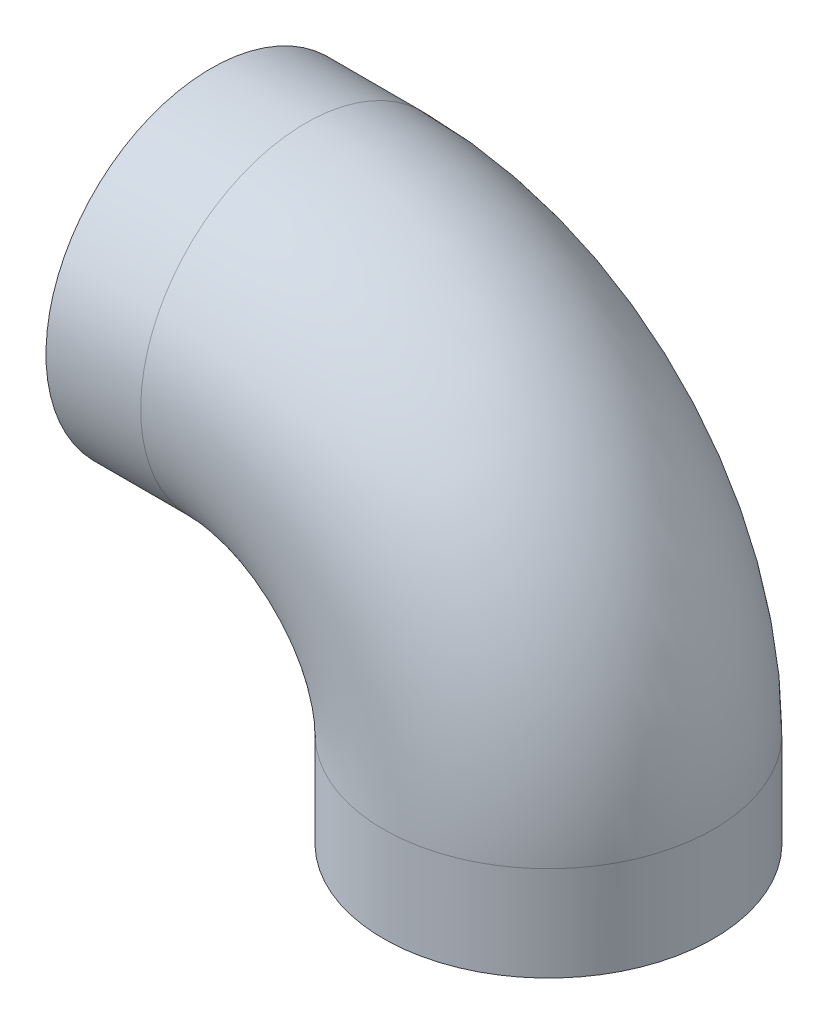
ISO-10303-21;
HEADER;
FILE_DESCRIPTION(('STEP AP214'),'2;1');
FILE_NAME('part.step','',(''),(''),'','','');
FILE_SCHEMA(('AUTOMOTIVE_DESIGN { 1 0 10303 214 1 1 1 1 }'));
ENDSEC;
DATA;
#1=APPLICATION_CONTEXT('core data for automotive mechanical design processes');
#2=APPLICATION_PROTOCOL_DEFINITION('international standard','automotive_design',2000,#1);
#3=PRODUCT_CONTEXT('',#1,'mechanical');
#4=PRODUCT('Part','Part','',(#3));
#5=PRODUCT_RELATED_PRODUCT_CATEGORY('part','',(#4));
#6=PRODUCT_DEFINITION_FORMATION('','',#4);
#7=PRODUCT_DEFINITION_CONTEXT('part definition',#1,'design');
#8=PRODUCT_DEFINITION('design','',#6,#7);
#9=PRODUCT_DEFINITION_SHAPE('','',#8);
#10=(LENGTH_UNIT() NAMED_UNIT(*) SI_UNIT(.MILLI.,.METRE.));
#11=(NAMED_UNIT(*) PLANE_ANGLE_UNIT() SI_UNIT($,.RADIAN.));
#12=(NAMED_UNIT(*) SI_UNIT($,.STERADIAN.) SOLID_ANGLE_UNIT());
#13=UNCERTAINTY_MEASURE_WITH_UNIT(LENGTH_MEASURE(1.E-05),#10,'distance_accuracy_value','');
#14=(GEOMETRIC_REPRESENTATION_CONTEXT(3) GLOBAL_UNCERTAINTY_ASSIGNED_CONTEXT((#13)) GLOBAL_UNIT_ASSIGNED_CONTEXT((#10,
#11,#12)) REPRESENTATION_CONTEXT('',''));
#15=CARTESIAN_POINT('',(0.,0.,0.));
#16=DIRECTION('',(0.,0.,1.));
#17=DIRECTION('',(1.,0.,0.));
#18=AXIS2_PLACEMENT_3D('',#15,#16,#17);
#19=CARTESIAN_POINT('',(0.,0.,0.));
#20=DIRECTION('',(1.,0.,0.));
#21=DIRECTION('',(0.,0.,-1.));
#22=AXIS2_PLACEMENT_3D('',#19,#20,#21);
#23=CYLINDRICAL_SURFACE('',#22,72.5043);
#24=CARTESIAN_POINT('',(50.8,0.,0.));
#25=DIRECTION('',(1.,0.,0.));
#26=DIRECTION('',(0.,0.,-1.));
#27=AXIS2_PLACEMENT_3D('',#24,#25,#26);
#28=CIRCLE('',#27,72.5043);
#29=CARTESIAN_POINT('',(50.8,-68.4823945422471,23.8125));
#30=VERTEX_POINT('',#29);
#31=CARTESIAN_POINT('',(50.8,-68.4823945422471,-23.8125));
#32=VERTEX_POINT('',#31);
#33=EDGE_CURVE('E186',#30,#32,#28,.F.);
#34=ORIENTED_EDGE('',*,*,#33,.F.);
#35=DIRECTION('',(1.,0.,0.));
#36=VECTOR('',#35,1.);
#37=CARTESIAN_POINT('',(0.,-68.4823945422471,23.8125));
#38=LINE('',#37,#36);
#39=CARTESIAN_POINT('',(44.45,-68.4823945422471,23.8125));
#40=VERTEX_POINT('',#39);
#41=EDGE_CURVE('E222',#30,#40,#38,.F.);
#42=ORIENTED_EDGE('',*,*,#41,.T.);
#43=CARTESIAN_POINT('',(44.45,0.,0.));
#44=DIRECTION('',(-1.,0.,0.));
#45=DIRECTION('',(0.,0.,1.));
#46=AXIS2_PLACEMENT_3D('',#43,#44,#45);
#47=CIRCLE('',#46,72.5043);
#48=CARTESIAN_POINT('',(44.45,-68.4823945422471,-23.8125));
#49=VERTEX_POINT('',#48);
#50=EDGE_CURVE('E177',#40,#49,#47,.T.);
#51=ORIENTED_EDGE('',*,*,#50,.T.);
#52=DIRECTION('',(1.,0.,0.));
#53=VECTOR('',#52,1.);
#54=CARTESIAN_POINT('',(0.,-68.4823945422471,-23.8125));
#55=LINE('',#54,#53);
#56=EDGE_CURVE('E66',#49,#32,#55,.T.);
#57=ORIENTED_EDGE('',*,*,#56,.T.);
#58=EDGE_LOOP('',(#34,#42,#51,#57));
#59=FACE_BOUND('',#58,.T.);
#60=ADVANCED_FACE('F44',(#59),#23,.F.);
#61=CARTESIAN_POINT('',(180.975,-130.175,0.));
#62=DIRECTION('',(0.,-1.,0.));
#63=DIRECTION('',(0.,0.,-1.));
#64=AXIS2_PLACEMENT_3D('',#61,#62,#63);
#65=CYLINDRICAL_SURFACE('',#64,72.5043);
#66=CARTESIAN_POINT('',(180.975,-136.525,0.));
#67=DIRECTION('',(0.,-1.,0.));
#68=DIRECTION('',(0.,0.,-1.));
#69=AXIS2_PLACEMENT_3D('',#66,#67,#68);
#70=CIRCLE('',#69,72.5043);
#71=CARTESIAN_POINT('',(112.492605457753,-136.525,-23.8125));
#72=VERTEX_POINT('',#71);
#73=CARTESIAN_POINT('',(112.492605457753,-136.525,23.8125));
#74=VERTEX_POINT('',#73);
#75=EDGE_CURVE('E172',#72,#74,#70,.T.);
#76=ORIENTED_EDGE('',*,*,#75,.T.);
#77=DIRECTION('',(0.,-1.,0.));
#78=VECTOR('',#77,1.);
#79=CARTESIAN_POINT('',(112.492605457753,-130.175,23.8125));
#80=LINE('',#79,#78);
#81=CARTESIAN_POINT('',(112.492605457753,-130.175,23.8125));
#82=VERTEX_POINT('',#81);
#83=EDGE_CURVE('E217',#74,#82,#80,.F.);
#84=ORIENTED_EDGE('',*,*,#83,.T.);
#85=CARTESIAN_POINT('',(180.975,-130.175,0.));
#86=DIRECTION('',(0.,-1.,0.));
#87=DIRECTION('',(0.,0.,-1.));
#88=AXIS2_PLACEMENT_3D('',#85,#86,#87);
#89=CIRCLE('',#88,72.5043);
#90=CARTESIAN_POINT('',(112.492605457753,-130.175,-23.8125));
#91=VERTEX_POINT('',#90);
#92=EDGE_CURVE('E181',#82,#91,#89,.F.);
#93=ORIENTED_EDGE('',*,*,#92,.T.);
#94=DIRECTION('',(0.,-1.,0.));
#95=VECTOR('',#94,1.);
#96=CARTESIAN_POINT('',(112.492605457753,-130.175,-23.8125));
#97=LINE('',#96,#95);
#98=EDGE_CURVE('E238',#91,#72,#97,.T.);
#99=ORIENTED_EDGE('',*,*,#98,.T.);
#100=EDGE_LOOP('',(#76,#84,#93,#99));
#101=FACE_BOUND('',#100,.T.);
#102=ADVANCED_FACE('F263',(#101),#65,.F.);
#103=CARTESIAN_POINT('',(0.,0.,0.));
#104=DIRECTION('',(1.,0.,0.));
#105=DIRECTION('',(0.,0.,-1.));
#106=AXIS2_PLACEMENT_3D('',#103,#104,#105);
#107=CYLINDRICAL_SURFACE('',#106,88.5571);
#108=CARTESIAN_POINT('',(0.,0.,0.));
#109=DIRECTION('',(1.,0.,0.));
#110=DIRECTION('',(0.,0.,-1.));
#111=AXIS2_PLACEMENT_3D('',#108,#109,#110);
#112=CIRCLE('',#111,88.5571);
#113=CARTESIAN_POINT('',(0.,0.,-88.5571));
#114=VERTEX_POINT('',#113);
#115=CARTESIAN_POINT('',(0.,-85.2955145606145,23.8125));
#116=VERTEX_POINT('',#115);
#117=EDGE_CURVE('E162',#114,#116,#112,.T.);
#118=ORIENTED_EDGE('',*,*,#117,.T.);
#119=DIRECTION('',(1.,0.,0.));
#120=VECTOR('',#119,1.);
#121=CARTESIAN_POINT('',(0.,-85.2955145606145,23.8125));
#122=LINE('',#121,#120);
#123=CARTESIAN_POINT('',(50.8,-85.2955145606145,23.8125));
#124=VERTEX_POINT('',#123);
#125=EDGE_CURVE('E200',#116,#124,#122,.T.);
#126=ORIENTED_EDGE('',*,*,#125,.T.);
#127=CARTESIAN_POINT('',(50.8,0.,0.));
#128=DIRECTION('',(1.,0.,0.));
#129=DIRECTION('',(0.,0.,-1.));
#130=AXIS2_PLACEMENT_3D('',#127,#128,#129);
#131=CIRCLE('',#130,88.5571);
#132=CARTESIAN_POINT('',(50.8,-85.2955145606145,-23.8125));
#133=VERTEX_POINT('',#132);
#134=EDGE_CURVE('E157',#133,#124,#131,.T.);
#135=ORIENTED_EDGE('',*,*,#134,.F.);
#136=DIRECTION('',(1.,0.,0.));
#137=VECTOR('',#136,1.);
#138=CARTESIAN_POINT('',(0.,-85.2955145606145,-23.8125));
#139=LINE('',#138,#137);
#140=CARTESIAN_POINT('',(0.,-85.2955145606145,-23.8125));
#141=VERTEX_POINT('',#140);
#142=EDGE_CURVE('E139',#133,#141,#139,.F.);
#143=ORIENTED_EDGE('',*,*,#142,.T.);
#144=EDGE_CURVE('E153',#141,#114,#112,.T.);
#145=ORIENTED_EDGE('',*,*,#144,.T.);
#146=EDGE_LOOP('',(#118,#126,#135,#143,#145));
#147=FACE_BOUND('',#146,.T.);
#148=ADVANCED_FACE('F152',(#147),#107,.T.);
#149=CARTESIAN_POINT('',(50.8,-130.175,0.));
#150=DIRECTION('',(0.,0.,-1.));
#151=DIRECTION('',(-1.,0.,0.));
#152=AXIS2_PLACEMENT_3D('',#149,#150,#151);
#153=TOROIDAL_SURFACE('',#152,130.175,88.5571);
#154=ORIENTED_EDGE('',*,*,#134,.T.);
#155=CARTESIAN_POINT('',(50.8,-130.175,23.8125));
#156=DIRECTION('',(0.,0.,1.));
#157=DIRECTION('',(1.,0.,0.));
#158=AXIS2_PLACEMENT_3D('',#155,#156,#157);
#159=CIRCLE('',#158,44.8794854393855);
#160=CARTESIAN_POINT('',(95.6794854393855,-130.175,23.8125));
#161=VERTEX_POINT('',#160);
#162=EDGE_CURVE('E203',#124,#161,#159,.F.);
#163=ORIENTED_EDGE('',*,*,#162,.T.);
#164=CARTESIAN_POINT('',(180.975,-130.175,0.));
#165=DIRECTION('',(0.,-1.,0.));
#166=DIRECTION('',(0.,0.,-1.));
#167=AXIS2_PLACEMENT_3D('',#164,#165,#166);
#168=CIRCLE('',#167,88.5571);
#169=CARTESIAN_POINT('',(95.6794854393855,-130.175,-23.8125));
#170=VERTEX_POINT('',#169);
#171=EDGE_CURVE('E163',#170,#161,#168,.T.);
#172=ORIENTED_EDGE('',*,*,#171,.F.);
#173=CARTESIAN_POINT('',(50.8,-130.175,-23.8125));
#174=DIRECTION('',(0.,0.,-1.));
#175=DIRECTION('',(-1.,0.,0.));
#176=AXIS2_PLACEMENT_3D('',#173,#174,#175);
#177=CIRCLE('',#176,44.8794854393855);
#178=EDGE_CURVE('E158',#170,#133,#177,.F.);
#179=ORIENTED_EDGE('',*,*,#178,.T.);
#180=EDGE_LOOP('',(#154,#163,#172,#179));
#181=FACE_BOUND('',#180,.T.);
#182=ADVANCED_FACE('F246',(#181),#153,.T.);
#183=CARTESIAN_POINT('',(180.975,-130.175,0.));
#184=DIRECTION('',(0.,-1.,0.));
#185=DIRECTION('',(0.,0.,-1.));
#186=AXIS2_PLACEMENT_3D('',#183,#184,#185);
#187=CYLINDRICAL_SURFACE('',#186,88.5571);
#188=ORIENTED_EDGE('',*,*,#171,.T.);
#189=DIRECTION('',(0.,-1.,0.));
#190=VECTOR('',#189,1.);
#191=CARTESIAN_POINT('',(95.6794854393855,-130.175,23.8125));
#192=LINE('',#191,#190);
#193=CARTESIAN_POINT('',(95.6794854393855,-180.975,23.8125));
#194=VERTEX_POINT('',#193);
#195=EDGE_CURVE('E206',#161,#194,#192,.T.);
#196=ORIENTED_EDGE('',*,*,#195,.T.);
#197=CARTESIAN_POINT('',(180.975,-180.975,0.));
#198=DIRECTION('',(0.,-1.,0.));
#199=DIRECTION('',(0.,0.,-1.));
#200=AXIS2_PLACEMENT_3D('',#197,#198,#199);
#201=CIRCLE('',#200,88.5571);
#202=CARTESIAN_POINT('',(180.975,-180.975,-88.5571));
#203=VERTEX_POINT('',#202);
#204=EDGE_CURVE('E170',#203,#194,#201,.T.);
#205=ORIENTED_EDGE('',*,*,#204,.F.);
#206=CARTESIAN_POINT('',(95.6794854393855,-180.975,-23.8125));
#207=VERTEX_POINT('',#206);
#208=EDGE_CURVE('E165',#207,#203,#201,.T.);
#209=ORIENTED_EDGE('',*,*,#208,.F.);
#210=DIRECTION('',(0.,-1.,0.));
#211=VECTOR('',#210,1.);
#212=CARTESIAN_POINT('',(95.6794854393855,-130.175,-23.8125));
#213=LINE('',#212,#211);
#214=EDGE_CURVE('E227',#207,#170,#213,.F.);
#215=ORIENTED_EDGE('',*,*,#214,.T.);
#216=EDGE_LOOP('',(#188,#196,#205,#209,#215));
#217=FACE_BOUND('',#216,.T.);
#218=ADVANCED_FACE('F46',(#217),#187,.T.);
#219=CARTESIAN_POINT('',(0.,0.,0.));
#220=DIRECTION('',(1.,0.,0.));
#221=DIRECTION('',(0.,0.,-1.));
#222=AXIS2_PLACEMENT_3D('',#219,#220,#221);
#223=PLANE('',#222);
#224=DIRECTION('',(0.,-1.,0.));
#225=VECTOR('',#224,1.);
#226=CARTESIAN_POINT('',(0.,-219.075,23.8125));
#227=LINE('',#226,#225);
#228=CARTESIAN_POINT('',(0.,-80.6974829223316,23.8125));
#229=VERTEX_POINT('',#228);
#230=EDGE_CURVE('E147',#229,#116,#227,.T.);
#231=ORIENTED_EDGE('',*,*,#230,.T.);
#232=ORIENTED_EDGE('',*,*,#117,.F.);
#233=ORIENTED_EDGE('',*,*,#144,.F.);
#234=DIRECTION('',(0.,1.,0.));
#235=VECTOR('',#234,1.);
#236=CARTESIAN_POINT('',(0.,-219.075,-23.8125));
#237=LINE('',#236,#235);
#238=CARTESIAN_POINT('',(0.,-80.6974829223316,-23.8125));
#239=VERTEX_POINT('',#238);
#240=EDGE_CURVE('E136',#141,#239,#237,.T.);
#241=ORIENTED_EDGE('',*,*,#240,.T.);
#242=CARTESIAN_POINT('',(0.,0.,0.));
#243=DIRECTION('',(-1.,0.,0.));
#244=DIRECTION('',(0.,0.,1.));
#245=AXIS2_PLACEMENT_3D('',#242,#243,#244);
#246=CIRCLE('',#245,84.1375);
#247=EDGE_CURVE('E198',#229,#239,#246,.T.);
#248=ORIENTED_EDGE('',*,*,#247,.F.);
#249=EDGE_LOOP('',(#231,#232,#233,#241,#248));
#250=FACE_BOUND('',#249,.T.);
#251=ADVANCED_FACE('F161',(#250),#223,.F.);
#252=CARTESIAN_POINT('',(180.975,-180.975,0.));
#253=DIRECTION('',(0.,-1.,0.));
#254=DIRECTION('',(0.,0.,-1.));
#255=AXIS2_PLACEMENT_3D('',#252,#253,#254);
#256=PLANE('',#255);
#257=ORIENTED_EDGE('',*,*,#204,.T.);
#258=DIRECTION('',(1.,0.,0.));
#259=VECTOR('',#258,1.);
#260=CARTESIAN_POINT('',(180.975,-180.975,23.8125));
#261=LINE('',#260,#259);
#262=CARTESIAN_POINT('',(100.277517077668,-180.975,23.8125));
#263=VERTEX_POINT('',#262);
#264=EDGE_CURVE('E209',#194,#263,#261,.T.);
#265=ORIENTED_EDGE('',*,*,#264,.T.);
#266=CARTESIAN_POINT('',(180.975,-180.975,0.));
#267=DIRECTION('',(0.,-1.,0.));
#268=DIRECTION('',(0.,0.,-1.));
#269=AXIS2_PLACEMENT_3D('',#266,#267,#268);
#270=CIRCLE('',#269,84.1375);
#271=CARTESIAN_POINT('',(100.277517077668,-180.975,-23.8125));
#272=VERTEX_POINT('',#271);
#273=EDGE_CURVE('E179',#272,#263,#270,.T.);
#274=ORIENTED_EDGE('',*,*,#273,.F.);
#275=DIRECTION('',(-1.,0.,0.));
#276=VECTOR('',#275,1.);
#277=CARTESIAN_POINT('',(180.975,-180.975,-23.8125));
#278=LINE('',#277,#276);
#279=EDGE_CURVE('E230',#272,#207,#278,.T.);
#280=ORIENTED_EDGE('',*,*,#279,.T.);
#281=ORIENTED_EDGE('',*,*,#208,.T.);
#282=EDGE_LOOP('',(#257,#265,#274,#280,#281));
#283=FACE_BOUND('',#282,.T.);
#284=ADVANCED_FACE('F253',(#283),#256,.T.);
#285=CARTESIAN_POINT('',(50.8,-130.175,0.));
#286=DIRECTION('',(0.,0.,-1.));
#287=DIRECTION('',(-1.,0.,0.));
#288=AXIS2_PLACEMENT_3D('',#285,#286,#287);
#289=TOROIDAL_SURFACE('',#288,130.175,72.5043);
#290=ORIENTED_EDGE('',*,*,#92,.F.);
#291=CARTESIAN_POINT('',(50.8,-130.175,23.8125));
#292=DIRECTION('',(0.,0.,1.));
#293=DIRECTION('',(1.,0.,0.));
#294=AXIS2_PLACEMENT_3D('',#291,#292,#293);
#295=CIRCLE('',#294,61.6926054577529);
#296=EDGE_CURVE('E219',#82,#30,#295,.T.);
#297=ORIENTED_EDGE('',*,*,#296,.T.);
#298=ORIENTED_EDGE('',*,*,#33,.T.);
#299=CARTESIAN_POINT('',(50.8,-130.175,-23.8125));
#300=DIRECTION('',(0.,0.,-1.));
#301=DIRECTION('',(-1.,0.,0.));
#302=AXIS2_PLACEMENT_3D('',#299,#300,#301);
#303=CIRCLE('',#302,61.6926054577529);
#304=EDGE_CURVE('E240',#32,#91,#303,.T.);
#305=ORIENTED_EDGE('',*,*,#304,.T.);
#306=EDGE_LOOP('',(#290,#297,#298,#305));
#307=FACE_BOUND('',#306,.T.);
#308=ADVANCED_FACE('F265',(#307),#289,.F.);
#309=CARTESIAN_POINT('',(180.975,-136.525,0.));
#310=DIRECTION('',(0.,-1.,0.));
#311=DIRECTION('',(0.,0.,-1.));
#312=AXIS2_PLACEMENT_3D('',#309,#310,#311);
#313=CYLINDRICAL_SURFACE('',#312,84.1375);
#314=DIRECTION('',(0.,-1.,0.));
#315=VECTOR('',#314,1.);
#316=CARTESIAN_POINT('',(100.277517077668,-136.525,23.8125));
#317=LINE('',#316,#315);
#318=CARTESIAN_POINT('',(100.277517077668,-136.525,23.8125));
#319=VERTEX_POINT('',#318);
#320=EDGE_CURVE('E212',#319,#263,#317,.T.);
#321=ORIENTED_EDGE('',*,*,#320,.F.);
#322=CARTESIAN_POINT('',(180.975,-136.525,0.));
#323=DIRECTION('',(0.,-1.,0.));
#324=DIRECTION('',(0.,0.,-1.));
#325=AXIS2_PLACEMENT_3D('',#322,#323,#324);
#326=CIRCLE('',#325,84.1375);
#327=CARTESIAN_POINT('',(100.277517077668,-136.525,-23.8125));
#328=VERTEX_POINT('',#327);
#329=EDGE_CURVE('E176',#328,#319,#326,.T.);
#330=ORIENTED_EDGE('',*,*,#329,.F.);
#331=DIRECTION('',(0.,-1.,0.));
#332=VECTOR('',#331,1.);
#333=CARTESIAN_POINT('',(100.277517077668,-136.525,-23.8125));
#334=LINE('',#333,#332);
#335=EDGE_CURVE('E233',#272,#328,#334,.F.);
#336=ORIENTED_EDGE('',*,*,#335,.F.);
#337=ORIENTED_EDGE('',*,*,#273,.T.);
#338=EDGE_LOOP('',(#321,#330,#336,#337));
#339=FACE_BOUND('',#338,.T.);
#340=ADVANCED_FACE('F258',(#339),#313,.F.);
#341=CARTESIAN_POINT('',(180.975,-136.525,0.));
#342=DIRECTION('',(0.,-1.,0.));
#343=DIRECTION('',(0.,0.,-1.));
#344=AXIS2_PLACEMENT_3D('',#341,#342,#343);
#345=PLANE('',#344);
#346=ORIENTED_EDGE('',*,*,#329,.T.);
#347=DIRECTION('',(1.,0.,0.));
#348=VECTOR('',#347,1.);
#349=CARTESIAN_POINT('',(180.975,-136.525,23.8125));
#350=LINE('',#349,#348);
#351=EDGE_CURVE('E214',#319,#74,#350,.T.);
#352=ORIENTED_EDGE('',*,*,#351,.T.);
#353=ORIENTED_EDGE('',*,*,#75,.F.);
#354=DIRECTION('',(-1.,0.,0.));
#355=VECTOR('',#354,1.);
#356=CARTESIAN_POINT('',(180.975,-136.525,-23.8125));
#357=LINE('',#356,#355);
#358=EDGE_CURVE('E235',#72,#328,#357,.T.);
#359=ORIENTED_EDGE('',*,*,#358,.T.);
#360=EDGE_LOOP('',(#346,#352,#353,#359));
#361=FACE_BOUND('',#360,.T.);
#362=ADVANCED_FACE('F262',(#361),#345,.T.);
#363=CARTESIAN_POINT('',(44.45,0.,0.));
#364=DIRECTION('',(-1.,0.,0.));
#365=DIRECTION('',(0.,0.,1.));
#366=AXIS2_PLACEMENT_3D('',#363,#364,#365);
#367=CYLINDRICAL_SURFACE('',#366,84.1375);
#368=DIRECTION('',(-1.,0.,0.));
#369=VECTOR('',#368,1.);
#370=CARTESIAN_POINT('',(44.45,-80.6974829223316,23.8125));
#371=LINE('',#370,#369);
#372=CARTESIAN_POINT('',(44.45,-80.6974829223316,23.8125));
#373=VERTEX_POINT('',#372);
#374=EDGE_CURVE('E59',#229,#373,#371,.F.);
#375=ORIENTED_EDGE('',*,*,#374,.F.);
#376=ORIENTED_EDGE('',*,*,#247,.T.);
#377=DIRECTION('',(-1.,0.,0.));
#378=VECTOR('',#377,1.);
#379=CARTESIAN_POINT('',(44.45,-80.6974829223316,-23.8125));
#380=LINE('',#379,#378);
#381=CARTESIAN_POINT('',(44.45,-80.6974829223316,-23.8125));
#382=VERTEX_POINT('',#381);
#383=EDGE_CURVE('E142',#382,#239,#380,.T.);
#384=ORIENTED_EDGE('',*,*,#383,.F.);
#385=CARTESIAN_POINT('',(44.45,0.,0.));
#386=DIRECTION('',(-1.,0.,0.));
#387=DIRECTION('',(0.,0.,1.));
#388=AXIS2_PLACEMENT_3D('',#385,#386,#387);
#389=CIRCLE('',#388,84.1375);
#390=EDGE_CURVE('E180',#373,#382,#389,.T.);
#391=ORIENTED_EDGE('',*,*,#390,.F.);
#392=EDGE_LOOP('',(#375,#376,#384,#391));
#393=FACE_BOUND('',#392,.T.);
#394=ADVANCED_FACE('F271',(#393),#367,.F.);
#395=CARTESIAN_POINT('',(44.45,0.,0.));
#396=DIRECTION('',(-1.,0.,0.));
#397=DIRECTION('',(0.,0.,1.));
#398=AXIS2_PLACEMENT_3D('',#395,#396,#397);
#399=PLANE('',#398);
#400=ORIENTED_EDGE('',*,*,#50,.F.);
#401=DIRECTION('',(0.,-1.,0.));
#402=VECTOR('',#401,1.);
#403=CARTESIAN_POINT('',(44.45,0.,23.8125));
#404=LINE('',#403,#402);
#405=EDGE_CURVE('E13',#40,#373,#404,.T.);
#406=ORIENTED_EDGE('',*,*,#405,.T.);
#407=ORIENTED_EDGE('',*,*,#390,.T.);
#408=DIRECTION('',(0.,1.,0.));
#409=VECTOR('',#408,1.);
#410=CARTESIAN_POINT('',(44.45,0.,-23.8125));
#411=LINE('',#410,#409);
#412=EDGE_CURVE('E52',#382,#49,#411,.T.);
#413=ORIENTED_EDGE('',*,*,#412,.T.);
#414=EDGE_LOOP('',(#400,#406,#407,#413));
#415=FACE_BOUND('',#414,.T.);
#416=ADVANCED_FACE('F268',(#415),#399,.T.);
#417=CARTESIAN_POINT('',(152.4,-219.075,-23.8125));
#418=DIRECTION('',(0.,0.,1.));
#419=DIRECTION('',(1.,0.,0.));
#420=AXIS2_PLACEMENT_3D('',#417,#418,#419);
#421=PLANE('',#420);
#422=ORIENTED_EDGE('',*,*,#178,.F.);
#423=ORIENTED_EDGE('',*,*,#214,.F.);
#424=ORIENTED_EDGE('',*,*,#279,.F.);
#425=ORIENTED_EDGE('',*,*,#335,.T.);
#426=ORIENTED_EDGE('',*,*,#358,.F.);
#427=ORIENTED_EDGE('',*,*,#98,.F.);
#428=ORIENTED_EDGE('',*,*,#304,.F.);
#429=ORIENTED_EDGE('',*,*,#56,.F.);
#430=ORIENTED_EDGE('',*,*,#412,.F.);
#431=ORIENTED_EDGE('',*,*,#383,.T.);
#432=ORIENTED_EDGE('',*,*,#240,.F.);
#433=ORIENTED_EDGE('',*,*,#142,.F.);
#434=EDGE_LOOP('',(#422,#423,#424,#425,#426,#427,#428,#429,#430,#431,#432,#433));
#435=FACE_BOUND('',#434,.T.);
#436=ADVANCED_FACE('F138',(#435),#421,.T.);
#437=CARTESIAN_POINT('',(152.4,-219.075,23.8125));
#438=DIRECTION('',(0.,0.,-1.));
#439=DIRECTION('',(-1.,0.,0.));
#440=AXIS2_PLACEMENT_3D('',#437,#438,#439);
#441=PLANE('',#440);
#442=ORIENTED_EDGE('',*,*,#230,.F.);
#443=ORIENTED_EDGE('',*,*,#374,.T.);
#444=ORIENTED_EDGE('',*,*,#405,.F.);
#445=ORIENTED_EDGE('',*,*,#41,.F.);
#446=ORIENTED_EDGE('',*,*,#296,.F.);
#447=ORIENTED_EDGE('',*,*,#83,.F.);
#448=ORIENTED_EDGE('',*,*,#351,.F.);
#449=ORIENTED_EDGE('',*,*,#320,.T.);
#450=ORIENTED_EDGE('',*,*,#264,.F.);
#451=ORIENTED_EDGE('',*,*,#195,.F.);
#452=ORIENTED_EDGE('',*,*,#162,.F.);
#453=ORIENTED_EDGE('',*,*,#125,.F.);
#454=EDGE_LOOP('',(#442,#443,#444,#445,#446,#447,#448,#449,#450,#451,#452,#453));
#455=FACE_BOUND('',#454,.T.);
#456=ADVANCED_FACE('F341',(#455),#441,.T.);
#457=CLOSED_SHELL('',(#60,#102,#148,#182,#218,#251,#284,#308,#340,#362,#394,#416,#436,#456));
#458=MANIFOLD_SOLID_BREP('B2',#457);
#459=ADVANCED_BREP_SHAPE_REPRESENTATION('',(#18,#458),#14);
#460=SHAPE_DEFINITION_REPRESENTATION(#9,#459);
ENDSEC;
END-ISO-10303-21;
